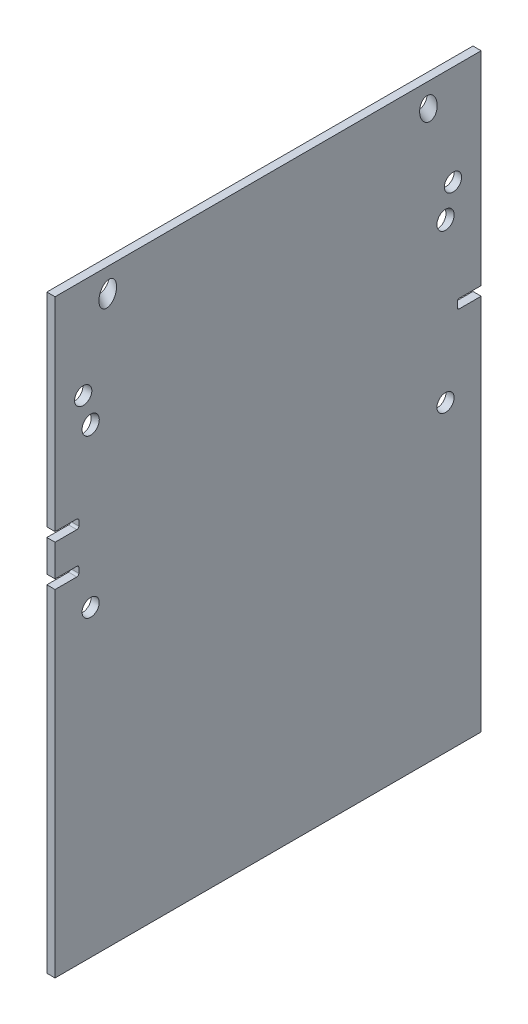
ISO-10303-21;
HEADER;
FILE_DESCRIPTION(('STEP AP214'),'2;1');
FILE_NAME('part.step','',(''),(''),'','','');
FILE_SCHEMA(('AUTOMOTIVE_DESIGN { 1 0 10303 214 1 1 1 1 }'));
ENDSEC;
DATA;
#1=APPLICATION_CONTEXT('core data for automotive mechanical design processes');
#2=APPLICATION_PROTOCOL_DEFINITION('international standard','automotive_design',2000,#1);
#3=PRODUCT_CONTEXT('',#1,'mechanical');
#4=PRODUCT('Part','Part','',(#3));
#5=PRODUCT_RELATED_PRODUCT_CATEGORY('part','',(#4));
#6=PRODUCT_DEFINITION_FORMATION('','',#4);
#7=PRODUCT_DEFINITION_CONTEXT('part definition',#1,'design');
#8=PRODUCT_DEFINITION('design','',#6,#7);
#9=PRODUCT_DEFINITION_SHAPE('','',#8);
#10=(LENGTH_UNIT() NAMED_UNIT(*) SI_UNIT(.MILLI.,.METRE.));
#11=(NAMED_UNIT(*) PLANE_ANGLE_UNIT() SI_UNIT($,.RADIAN.));
#12=(NAMED_UNIT(*) SI_UNIT($,.STERADIAN.) SOLID_ANGLE_UNIT());
#13=UNCERTAINTY_MEASURE_WITH_UNIT(LENGTH_MEASURE(1.E-05),#10,'distance_accuracy_value','');
#14=(GEOMETRIC_REPRESENTATION_CONTEXT(3) GLOBAL_UNCERTAINTY_ASSIGNED_CONTEXT((#13)) GLOBAL_UNIT_ASSIGNED_CONTEXT((#10,
#11,#12)) REPRESENTATION_CONTEXT('',''));
#15=CARTESIAN_POINT('',(0.,0.,0.));
#16=DIRECTION('',(0.,0.,1.));
#17=DIRECTION('',(1.,0.,0.));
#18=AXIS2_PLACEMENT_3D('',#15,#16,#17);
#19=CARTESIAN_POINT('',(2463.8,444.5,330.2));
#20=DIRECTION('',(0.,0.,-1.));
#21=DIRECTION('',(-1.,0.,0.));
#22=AXIS2_PLACEMENT_3D('',#19,#20,#21);
#23=PLANE('',#22);
#24=DIRECTION('',(0.,-1.,0.));
#25=VECTOR('',#24,1.);
#26=CARTESIAN_POINT('',(2463.8,444.5,330.2));
#27=LINE('',#26,#25);
#28=CARTESIAN_POINT('',(2463.8,115.038,330.2));
#29=VERTEX_POINT('',#28);
#30=CARTESIAN_POINT('',(2463.8,65.762,330.2));
#31=VERTEX_POINT('',#30);
#32=EDGE_CURVE('E223',#29,#31,#27,.T.);
#33=ORIENTED_EDGE('',*,*,#32,.T.);
#34=DIRECTION('',(1.,0.,0.));
#35=VECTOR('',#34,1.);
#36=CARTESIAN_POINT('',(2463.8,65.762,330.2));
#37=LINE('',#36,#35);
#38=CARTESIAN_POINT('',(2476.5,65.762,330.2));
#39=VERTEX_POINT('',#38);
#40=EDGE_CURVE('E327',#31,#39,#37,.T.);
#41=ORIENTED_EDGE('',*,*,#40,.T.);
#42=DIRECTION('',(0.,-1.,0.));
#43=VECTOR('',#42,1.);
#44=CARTESIAN_POINT('',(2476.5,444.5,330.2));
#45=LINE('',#44,#43);
#46=CARTESIAN_POINT('',(2476.5,115.038,330.2));
#47=VERTEX_POINT('',#46);
#48=EDGE_CURVE('E261',#47,#39,#45,.T.);
#49=ORIENTED_EDGE('',*,*,#48,.F.);
#50=DIRECTION('',(-1.,0.,0.));
#51=VECTOR('',#50,1.);
#52=CARTESIAN_POINT('',(2463.8,115.038,330.2));
#53=LINE('',#52,#51);
#54=EDGE_CURVE('E312',#47,#29,#53,.T.);
#55=ORIENTED_EDGE('',*,*,#54,.T.);
#56=EDGE_LOOP('',(#33,#41,#49,#55));
#57=FACE_BOUND('',#56,.T.);
#58=ADVANCED_FACE('F44',(#57),#23,.F.);
#59=CARTESIAN_POINT('',(2463.8,444.5,-330.2));
#60=DIRECTION('',(0.,0.,1.));
#61=DIRECTION('',(1.,0.,0.));
#62=AXIS2_PLACEMENT_3D('',#59,#60,#61);
#63=PLANE('',#62);
#64=DIRECTION('',(0.,-1.,0.));
#65=VECTOR('',#64,1.);
#66=CARTESIAN_POINT('',(2463.8,444.5,-330.2));
#67=LINE('',#66,#65);
#68=CARTESIAN_POINT('',(2463.8,115.038,-330.2));
#69=VERTEX_POINT('',#68);
#70=CARTESIAN_POINT('',(2463.8,-469.9,-330.2));
#71=VERTEX_POINT('',#70);
#72=EDGE_CURVE('E247',#69,#71,#67,.T.);
#73=ORIENTED_EDGE('',*,*,#72,.F.);
#74=DIRECTION('',(1.,0.,0.));
#75=VECTOR('',#74,1.);
#76=CARTESIAN_POINT('',(2463.8,115.038,-330.2));
#77=LINE('',#76,#75);
#78=CARTESIAN_POINT('',(2476.5,115.038,-330.2));
#79=VERTEX_POINT('',#78);
#80=EDGE_CURVE('E340',#69,#79,#77,.T.);
#81=ORIENTED_EDGE('',*,*,#80,.T.);
#82=DIRECTION('',(0.,-1.,0.));
#83=VECTOR('',#82,1.);
#84=CARTESIAN_POINT('',(2476.5,444.5,-330.2));
#85=LINE('',#84,#83);
#86=CARTESIAN_POINT('',(2476.5,-469.9,-330.2));
#87=VERTEX_POINT('',#86);
#88=EDGE_CURVE('E256',#79,#87,#85,.T.);
#89=ORIENTED_EDGE('',*,*,#88,.T.);
#90=DIRECTION('',(-1.,0.,0.));
#91=VECTOR('',#90,1.);
#92=CARTESIAN_POINT('',(2463.8,-469.9,-330.2));
#93=LINE('',#92,#91);
#94=EDGE_CURVE('E253',#87,#71,#93,.T.);
#95=ORIENTED_EDGE('',*,*,#94,.T.);
#96=EDGE_LOOP('',(#73,#81,#89,#95));
#97=FACE_BOUND('',#96,.T.);
#98=ADVANCED_FACE('F499',(#97),#63,.F.);
#99=CARTESIAN_POINT('',(2463.8,444.5,330.2));
#100=VERTEX_POINT('',#99);
#101=CARTESIAN_POINT('',(2463.8,129.262,330.2));
#102=VERTEX_POINT('',#101);
#103=EDGE_CURVE('E198',#100,#102,#27,.T.);
#104=ORIENTED_EDGE('',*,*,#103,.T.);
#105=DIRECTION('',(1.,0.,0.));
#106=VECTOR('',#105,1.);
#107=CARTESIAN_POINT('',(2463.8,129.262,330.2));
#108=LINE('',#107,#106);
#109=CARTESIAN_POINT('',(2476.5,129.262,330.2));
#110=VERTEX_POINT('',#109);
#111=EDGE_CURVE('E290',#102,#110,#108,.T.);
#112=ORIENTED_EDGE('',*,*,#111,.T.);
#113=CARTESIAN_POINT('',(2476.5,444.5,330.2));
#114=VERTEX_POINT('',#113);
#115=EDGE_CURVE('E200',#114,#110,#45,.T.);
#116=ORIENTED_EDGE('',*,*,#115,.F.);
#117=DIRECTION('',(1.,0.,0.));
#118=VECTOR('',#117,1.);
#119=CARTESIAN_POINT('',(2463.8,444.5,330.2));
#120=LINE('',#119,#118);
#121=EDGE_CURVE('E193',#100,#114,#120,.T.);
#122=ORIENTED_EDGE('',*,*,#121,.F.);
#123=EDGE_LOOP('',(#104,#112,#116,#122));
#124=FACE_BOUND('',#123,.T.);
#125=ADVANCED_FACE('F195',(#124),#23,.F.);
#126=CARTESIAN_POINT('',(2463.8,444.5,-330.2));
#127=DIRECTION('',(1.,0.,0.));
#128=DIRECTION('',(0.,0.,-1.));
#129=AXIS2_PLACEMENT_3D('',#126,#127,#128);
#130=PLANE('',#129);
#131=DIRECTION('',(0.,0.,-1.));
#132=VECTOR('',#131,1.);
#133=CARTESIAN_POINT('',(2463.8,51.538,-330.2));
#134=LINE('',#133,#132);
#135=CARTESIAN_POINT('',(2463.8,51.538,330.2));
#136=VERTEX_POINT('',#135);
#137=CARTESIAN_POINT('',(2463.8,51.538,296.463));
#138=VERTEX_POINT('',#137);
#139=EDGE_CURVE('E279',#136,#138,#134,.T.);
#140=ORIENTED_EDGE('',*,*,#139,.T.);
#141=CARTESIAN_POINT('',(2463.8,54.713,296.463));
#142=DIRECTION('',(1.,0.,0.));
#143=DIRECTION('',(0.,0.,-1.));
#144=AXIS2_PLACEMENT_3D('',#141,#142,#143);
#145=CIRCLE('',#144,3.175);
#146=CARTESIAN_POINT('',(2463.8,54.713,293.288));
#147=VERTEX_POINT('',#146);
#148=EDGE_CURVE('E468',#138,#147,#145,.T.);
#149=ORIENTED_EDGE('',*,*,#148,.T.);
#150=DIRECTION('',(0.,1.,0.));
#151=VECTOR('',#150,1.);
#152=CARTESIAN_POINT('',(2463.8,52.3,293.288));
#153=LINE('',#152,#151);
#154=CARTESIAN_POINT('',(2463.8,62.587,293.288));
#155=VERTEX_POINT('',#154);
#156=EDGE_CURVE('E280',#147,#155,#153,.T.);
#157=ORIENTED_EDGE('',*,*,#156,.T.);
#158=CARTESIAN_POINT('',(2463.8,62.587,296.463));
#159=DIRECTION('',(1.,0.,0.));
#160=DIRECTION('',(0.,0.,-1.));
#161=AXIS2_PLACEMENT_3D('',#158,#159,#160);
#162=CIRCLE('',#161,3.175);
#163=CARTESIAN_POINT('',(2463.8,65.762,296.463));
#164=VERTEX_POINT('',#163);
#165=EDGE_CURVE('E474',#155,#164,#162,.T.);
#166=ORIENTED_EDGE('',*,*,#165,.T.);
#167=DIRECTION('',(0.,0.,1.));
#168=VECTOR('',#167,1.);
#169=CARTESIAN_POINT('',(2463.8,65.762,-330.2));
#170=LINE('',#169,#168);
#171=EDGE_CURVE('E323',#164,#31,#170,.T.);
#172=ORIENTED_EDGE('',*,*,#171,.T.);
#173=ORIENTED_EDGE('',*,*,#32,.F.);
#174=DIRECTION('',(0.,0.,-1.));
#175=VECTOR('',#174,1.);
#176=CARTESIAN_POINT('',(2463.8,115.038,-330.2));
#177=LINE('',#176,#175);
#178=CARTESIAN_POINT('',(2463.8,115.038,296.463));
#179=VERTEX_POINT('',#178);
#180=EDGE_CURVE('E293',#29,#179,#177,.T.);
#181=ORIENTED_EDGE('',*,*,#180,.T.);
#182=CARTESIAN_POINT('',(2463.8,118.213,296.463));
#183=DIRECTION('',(1.,0.,0.));
#184=DIRECTION('',(0.,0.,-1.));
#185=AXIS2_PLACEMENT_3D('',#182,#183,#184);
#186=CIRCLE('',#185,3.175);
#187=CARTESIAN_POINT('',(2463.8,118.213,293.288));
#188=VERTEX_POINT('',#187);
#189=EDGE_CURVE('E462',#179,#188,#186,.T.);
#190=ORIENTED_EDGE('',*,*,#189,.T.);
#191=DIRECTION('',(0.,1.,0.));
#192=VECTOR('',#191,1.);
#193=CARTESIAN_POINT('',(2463.8,115.8,293.288));
#194=LINE('',#193,#192);
#195=CARTESIAN_POINT('',(2463.8,126.087,293.288));
#196=VERTEX_POINT('',#195);
#197=EDGE_CURVE('E296',#188,#196,#194,.T.);
#198=ORIENTED_EDGE('',*,*,#197,.T.);
#199=CARTESIAN_POINT('',(2463.8,126.087,296.463));
#200=DIRECTION('',(1.,0.,0.));
#201=DIRECTION('',(0.,0.,-1.));
#202=AXIS2_PLACEMENT_3D('',#199,#200,#201);
#203=CIRCLE('',#202,3.175);
#204=CARTESIAN_POINT('',(2463.8,129.262,296.463));
#205=VERTEX_POINT('',#204);
#206=EDGE_CURVE('E12',#196,#205,#203,.T.);
#207=ORIENTED_EDGE('',*,*,#206,.T.);
#208=DIRECTION('',(0.,0.,1.));
#209=VECTOR('',#208,1.);
#210=CARTESIAN_POINT('',(2463.8,129.262,-330.2));
#211=LINE('',#210,#209);
#212=EDGE_CURVE('E219',#205,#102,#211,.T.);
#213=ORIENTED_EDGE('',*,*,#212,.T.);
#214=ORIENTED_EDGE('',*,*,#103,.F.);
#215=DIRECTION('',(0.,0.,1.));
#216=VECTOR('',#215,1.);
#217=CARTESIAN_POINT('',(2463.8,444.5,-330.2));
#218=LINE('',#217,#216);
#219=CARTESIAN_POINT('',(2463.8,444.5,-330.2));
#220=VERTEX_POINT('',#219);
#221=EDGE_CURVE('E205',#220,#100,#218,.T.);
#222=ORIENTED_EDGE('',*,*,#221,.F.);
#223=CARTESIAN_POINT('',(2463.8,129.262,-330.2));
#224=VERTEX_POINT('',#223);
#225=EDGE_CURVE('E242',#220,#224,#67,.T.);
#226=ORIENTED_EDGE('',*,*,#225,.T.);
#227=DIRECTION('',(0.,0.,1.));
#228=VECTOR('',#227,1.);
#229=CARTESIAN_POINT('',(2463.8,129.262,-330.2));
#230=LINE('',#229,#228);
#231=CARTESIAN_POINT('',(2463.8,129.262,-296.463000000001));
#232=VERTEX_POINT('',#231);
#233=EDGE_CURVE('E867',#224,#232,#230,.T.);
#234=ORIENTED_EDGE('',*,*,#233,.T.);
#235=CARTESIAN_POINT('',(2463.8,126.087,-296.463000000001));
#236=DIRECTION('',(1.,0.,0.));
#237=DIRECTION('',(0.,0.,-1.));
#238=AXIS2_PLACEMENT_3D('',#235,#236,#237);
#239=CIRCLE('',#238,3.175);
#240=CARTESIAN_POINT('',(2463.8,126.087,-293.288000000001));
#241=VERTEX_POINT('',#240);
#242=EDGE_CURVE('E456',#232,#241,#239,.T.);
#243=ORIENTED_EDGE('',*,*,#242,.T.);
#244=DIRECTION('',(0.,-1.,0.));
#245=VECTOR('',#244,1.);
#246=CARTESIAN_POINT('',(2463.8,128.5,-293.288000000001));
#247=LINE('',#246,#245);
#248=CARTESIAN_POINT('',(2463.8,118.213,-293.288000000001));
#249=VERTEX_POINT('',#248);
#250=EDGE_CURVE('E868',#241,#249,#247,.T.);
#251=ORIENTED_EDGE('',*,*,#250,.T.);
#252=CARTESIAN_POINT('',(2463.8,118.213,-296.463000000001));
#253=DIRECTION('',(1.,0.,0.));
#254=DIRECTION('',(0.,0.,-1.));
#255=AXIS2_PLACEMENT_3D('',#252,#253,#254);
#256=CIRCLE('',#255,3.175);
#257=CARTESIAN_POINT('',(2463.8,115.038,-296.463000000001));
#258=VERTEX_POINT('',#257);
#259=EDGE_CURVE('E450',#249,#258,#256,.T.);
#260=ORIENTED_EDGE('',*,*,#259,.T.);
#261=DIRECTION('',(0.,0.,-1.));
#262=VECTOR('',#261,1.);
#263=CARTESIAN_POINT('',(2463.8,115.038,-330.2));
#264=LINE('',#263,#262);
#265=EDGE_CURVE('E308',#258,#69,#264,.T.);
#266=ORIENTED_EDGE('',*,*,#265,.T.);
#267=ORIENTED_EDGE('',*,*,#72,.T.);
#268=DIRECTION('',(0.,0.,1.));
#269=VECTOR('',#268,1.);
#270=CARTESIAN_POINT('',(2463.8,-469.9,-330.2));
#271=LINE('',#270,#269);
#272=CARTESIAN_POINT('',(2463.8,-469.9,330.2));
#273=VERTEX_POINT('',#272);
#274=EDGE_CURVE('E250',#71,#273,#271,.T.);
#275=ORIENTED_EDGE('',*,*,#274,.T.);
#276=EDGE_CURVE('E225',#136,#273,#27,.T.);
#277=ORIENTED_EDGE('',*,*,#276,.F.);
#278=EDGE_LOOP('',(#140,#149,#157,#166,#172,#173,#181,#190,#198,#207,#213,#214,#222,#226,#234,
#243,#251,#260,#266,#267,#275,#277));
#279=FACE_BOUND('',#278,.T.);
#280=CARTESIAN_POINT('',(2463.8,240.627500000009,-275.000000000001));
#281=DIRECTION('',(1.,0.,0.));
#282=DIRECTION('',(0.,1.,0.));
#283=AXIS2_PLACEMENT_3D('',#280,#281,#282);
#284=ELLIPSE('',#283,14.1841170593698,13.335);
#285=CARTESIAN_POINT('',(2463.8,254.811617059379,-275.000000000001));
#286=VERTEX_POINT('',#285);
#287=EDGE_CURVE('E311',#286,#286,#284,.F.);
#288=ORIENTED_EDGE('',*,*,#287,.F.);
#289=EDGE_LOOP('',(#288));
#290=FACE_BOUND('',#289,.T.);
#291=CARTESIAN_POINT('',(2463.8,-7.12133119048504E-13,-275.000000000001));
#292=DIRECTION('',(1.,0.,0.));
#293=DIRECTION('',(0.,0.,-1.));
#294=AXIS2_PLACEMENT_3D('',#291,#292,#293);
#295=CIRCLE('',#294,13.335);
#296=CARTESIAN_POINT('',(2463.8,-7.12133119048504E-13,-288.335000000001));
#297=VERTEX_POINT('',#296);
#298=EDGE_CURVE('E389',#297,#297,#295,.F.);
#299=ORIENTED_EDGE('',*,*,#298,.F.);
#300=EDGE_LOOP('',(#299));
#301=FACE_BOUND('',#300,.T.);
#302=CARTESIAN_POINT('',(2463.8,289.999999999994,-287.768749999998));
#303=DIRECTION('',(1.,0.,0.));
#304=DIRECTION('',(0.,-1.68753899743025E-13,-1.));
#305=AXIS2_PLACEMENT_3D('',#302,#303,#304);
#306=ELLIPSE('',#305,13.3934728748526,13.335);
#307=CARTESIAN_POINT('',(2463.8,289.999999999991,-301.16222287485));
#308=VERTEX_POINT('',#307);
#309=EDGE_CURVE('E390',#308,#308,#306,.F.);
#310=ORIENTED_EDGE('',*,*,#309,.F.);
#311=EDGE_LOOP('',(#310));
#312=FACE_BOUND('',#311,.T.);
#313=CARTESIAN_POINT('',(2463.8,419.804647774969,-245.782156472755));
#314=DIRECTION('',(1.,0.,0.));
#315=DIRECTION('',(0.,0.975590762994734,0.219596591866432));
#316=AXIS2_PLACEMENT_3D('',#313,#314,#315);
#317=ELLIPSE('',#316,18.6418967373264,13.3350000000001);
#318=CARTESIAN_POINT('',(2463.8,437.991510036606,-241.688459483312));
#319=VERTEX_POINT('',#318);
#320=EDGE_CURVE('E348',#319,#319,#317,.F.);
#321=ORIENTED_EDGE('',*,*,#320,.F.);
#322=EDGE_LOOP('',(#321));
#323=FACE_BOUND('',#322,.T.);
#324=CARTESIAN_POINT('',(2463.8,419.804647774969,245.782156472754));
#325=DIRECTION('',(1.,0.,0.));
#326=DIRECTION('',(0.,-0.975590762994734,0.219596591866431));
#327=AXIS2_PLACEMENT_3D('',#324,#325,#326);
#328=ELLIPSE('',#327,18.6418967373263,13.335);
#329=CARTESIAN_POINT('',(2463.8,401.617785513332,249.875853462197));
#330=VERTEX_POINT('',#329);
#331=EDGE_CURVE('E349',#330,#330,#328,.F.);
#332=ORIENTED_EDGE('',*,*,#331,.F.);
#333=EDGE_LOOP('',(#332));
#334=FACE_BOUND('',#333,.T.);
#335=CARTESIAN_POINT('',(2463.8,240.627500000009,275.));
#336=DIRECTION('',(1.,0.,0.));
#337=DIRECTION('',(0.,-1.,0.));
#338=AXIS2_PLACEMENT_3D('',#335,#336,#337);
#339=ELLIPSE('',#338,14.1841170593698,13.335);
#340=CARTESIAN_POINT('',(2463.8,226.443382940639,275.));
#341=VERTEX_POINT('',#340);
#342=EDGE_CURVE('E358',#341,#341,#339,.F.);
#343=ORIENTED_EDGE('',*,*,#342,.F.);
#344=EDGE_LOOP('',(#343));
#345=FACE_BOUND('',#344,.T.);
#346=CARTESIAN_POINT('',(2463.8,-4.18286707223905E-12,275.));
#347=DIRECTION('',(1.,0.,0.));
#348=DIRECTION('',(0.,0.,-1.));
#349=AXIS2_PLACEMENT_3D('',#346,#347,#348);
#350=CIRCLE('',#349,13.335);
#351=CARTESIAN_POINT('',(2463.8,-4.18286707223905E-12,261.665));
#352=VERTEX_POINT('',#351);
#353=EDGE_CURVE('E375',#352,#352,#350,.F.);
#354=ORIENTED_EDGE('',*,*,#353,.F.);
#355=EDGE_LOOP('',(#354));
#356=FACE_BOUND('',#355,.T.);
#357=CARTESIAN_POINT('',(2463.8,289.999999999994,287.768749999997));
#358=DIRECTION('',(1.,0.,0.));
#359=DIRECTION('',(0.,-1.70234197109192E-13,1.));
#360=AXIS2_PLACEMENT_3D('',#357,#358,#359);
#361=ELLIPSE('',#360,13.3934728748526,13.335);
#362=CARTESIAN_POINT('',(2463.8,289.999999999991,301.162222874849));
#363=VERTEX_POINT('',#362);
#364=EDGE_CURVE('E366',#363,#363,#361,.F.);
#365=ORIENTED_EDGE('',*,*,#364,.F.);
#366=EDGE_LOOP('',(#365));
#367=FACE_BOUND('',#366,.T.);
#368=ADVANCED_FACE('F217',(#279,#290,#301,#312,#323,#334,#345,#356,#367),#130,.F.);
#369=CARTESIAN_POINT('',(2476.5,51.538,330.2));
#370=VERTEX_POINT('',#369);
#371=CARTESIAN_POINT('',(2476.5,-469.9,330.2));
#372=VERTEX_POINT('',#371);
#373=EDGE_CURVE('E229',#370,#372,#45,.T.);
#374=ORIENTED_EDGE('',*,*,#373,.F.);
#375=DIRECTION('',(-1.,0.,0.));
#376=VECTOR('',#375,1.);
#377=CARTESIAN_POINT('',(2463.8,51.538,330.2));
#378=LINE('',#377,#376);
#379=EDGE_CURVE('E276',#370,#136,#378,.T.);
#380=ORIENTED_EDGE('',*,*,#379,.T.);
#381=ORIENTED_EDGE('',*,*,#276,.T.);
#382=DIRECTION('',(1.,0.,0.));
#383=VECTOR('',#382,1.);
#384=CARTESIAN_POINT('',(2463.8,-469.9,330.2));
#385=LINE('',#384,#383);
#386=EDGE_CURVE('E235',#273,#372,#385,.T.);
#387=ORIENTED_EDGE('',*,*,#386,.T.);
#388=EDGE_LOOP('',(#374,#380,#381,#387));
#389=FACE_BOUND('',#388,.T.);
#390=ADVANCED_FACE('F275',(#389),#23,.F.);
#391=CARTESIAN_POINT('',(2476.5,444.5,-330.2));
#392=DIRECTION('',(-1.,0.,0.));
#393=DIRECTION('',(0.,0.,1.));
#394=AXIS2_PLACEMENT_3D('',#391,#392,#393);
#395=PLANE('',#394);
#396=DIRECTION('',(0.,1.,0.));
#397=VECTOR('',#396,1.);
#398=CARTESIAN_POINT('',(2476.5,444.5,293.288));
#399=LINE('',#398,#397);
#400=CARTESIAN_POINT('',(2476.5,54.713,293.288));
#401=VERTEX_POINT('',#400);
#402=CARTESIAN_POINT('',(2476.5,62.5869999999999,293.288));
#403=VERTEX_POINT('',#402);
#404=EDGE_CURVE('E322',#401,#403,#399,.T.);
#405=ORIENTED_EDGE('',*,*,#404,.F.);
#406=CARTESIAN_POINT('',(2476.5,54.713,296.463));
#407=DIRECTION('',(-1.,0.,0.));
#408=DIRECTION('',(0.,0.,1.));
#409=AXIS2_PLACEMENT_3D('',#406,#407,#408);
#410=CIRCLE('',#409,3.175);
#411=CARTESIAN_POINT('',(2476.5,51.538,296.463));
#412=VERTEX_POINT('',#411);
#413=EDGE_CURVE('E465',#401,#412,#410,.T.);
#414=ORIENTED_EDGE('',*,*,#413,.T.);
#415=DIRECTION('',(0.,0.,1.));
#416=VECTOR('',#415,1.);
#417=CARTESIAN_POINT('',(2476.5,51.538,-330.2));
#418=LINE('',#417,#416);
#419=EDGE_CURVE('E273',#412,#370,#418,.T.);
#420=ORIENTED_EDGE('',*,*,#419,.T.);
#421=ORIENTED_EDGE('',*,*,#373,.T.);
#422=DIRECTION('',(0.,0.,-1.));
#423=VECTOR('',#422,1.);
#424=CARTESIAN_POINT('',(2476.5,-469.9,-330.2));
#425=LINE('',#424,#423);
#426=EDGE_CURVE('E222',#372,#87,#425,.T.);
#427=ORIENTED_EDGE('',*,*,#426,.T.);
#428=ORIENTED_EDGE('',*,*,#88,.F.);
#429=DIRECTION('',(0.,0.,1.));
#430=VECTOR('',#429,1.);
#431=CARTESIAN_POINT('',(2476.5,115.038,-330.2));
#432=LINE('',#431,#430);
#433=CARTESIAN_POINT('',(2476.5,115.038,-296.463000000001));
#434=VERTEX_POINT('',#433);
#435=EDGE_CURVE('E878',#79,#434,#432,.T.);
#436=ORIENTED_EDGE('',*,*,#435,.T.);
#437=CARTESIAN_POINT('',(2476.5,118.213,-296.463000000001));
#438=DIRECTION('',(-1.,0.,0.));
#439=DIRECTION('',(0.,0.,1.));
#440=AXIS2_PLACEMENT_3D('',#437,#438,#439);
#441=CIRCLE('',#440,3.175);
#442=CARTESIAN_POINT('',(2476.5,118.213,-293.288000000001));
#443=VERTEX_POINT('',#442);
#444=EDGE_CURVE('E447',#434,#443,#441,.T.);
#445=ORIENTED_EDGE('',*,*,#444,.T.);
#446=DIRECTION('',(0.,-1.,0.));
#447=VECTOR('',#446,1.);
#448=CARTESIAN_POINT('',(2476.5,444.5,-293.288000000001));
#449=LINE('',#448,#447);
#450=CARTESIAN_POINT('',(2476.5,126.087,-293.288000000001));
#451=VERTEX_POINT('',#450);
#452=EDGE_CURVE('E326',#451,#443,#449,.T.);
#453=ORIENTED_EDGE('',*,*,#452,.F.);
#454=CARTESIAN_POINT('',(2476.5,126.087,-296.463000000001));
#455=DIRECTION('',(-1.,0.,0.));
#456=DIRECTION('',(0.,0.,1.));
#457=AXIS2_PLACEMENT_3D('',#454,#455,#456);
#458=CIRCLE('',#457,3.175);
#459=CARTESIAN_POINT('',(2476.5,129.262,-296.463000000001));
#460=VERTEX_POINT('',#459);
#461=EDGE_CURVE('E453',#451,#460,#458,.T.);
#462=ORIENTED_EDGE('',*,*,#461,.T.);
#463=DIRECTION('',(0.,0.,-1.));
#464=VECTOR('',#463,1.);
#465=CARTESIAN_POINT('',(2476.5,129.262,-330.2));
#466=LINE('',#465,#464);
#467=CARTESIAN_POINT('',(2476.5,129.262,-330.2));
#468=VERTEX_POINT('',#467);
#469=EDGE_CURVE('E863',#460,#468,#466,.T.);
#470=ORIENTED_EDGE('',*,*,#469,.T.);
#471=CARTESIAN_POINT('',(2476.5,444.5,-330.2));
#472=VERTEX_POINT('',#471);
#473=EDGE_CURVE('E214',#472,#468,#85,.T.);
#474=ORIENTED_EDGE('',*,*,#473,.F.);
#475=DIRECTION('',(0.,0.,-1.));
#476=VECTOR('',#475,1.);
#477=CARTESIAN_POINT('',(2476.5,444.5,-330.2));
#478=LINE('',#477,#476);
#479=EDGE_CURVE('E204',#114,#472,#478,.T.);
#480=ORIENTED_EDGE('',*,*,#479,.F.);
#481=ORIENTED_EDGE('',*,*,#115,.T.);
#482=DIRECTION('',(0.,0.,-1.));
#483=VECTOR('',#482,1.);
#484=CARTESIAN_POINT('',(2476.5,129.262,-330.2));
#485=LINE('',#484,#483);
#486=CARTESIAN_POINT('',(2476.5,129.262,296.463));
#487=VERTEX_POINT('',#486);
#488=EDGE_CURVE('E299',#110,#487,#485,.T.);
#489=ORIENTED_EDGE('',*,*,#488,.T.);
#490=CARTESIAN_POINT('',(2476.5,126.087,296.463));
#491=DIRECTION('',(-1.,0.,0.));
#492=DIRECTION('',(0.,0.,1.));
#493=AXIS2_PLACEMENT_3D('',#490,#491,#492);
#494=CIRCLE('',#493,3.175);
#495=CARTESIAN_POINT('',(2476.5,126.087,293.288));
#496=VERTEX_POINT('',#495);
#497=EDGE_CURVE('E53',#487,#496,#494,.T.);
#498=ORIENTED_EDGE('',*,*,#497,.T.);
#499=DIRECTION('',(0.,1.,0.));
#500=VECTOR('',#499,1.);
#501=CARTESIAN_POINT('',(2476.5,444.5,293.288));
#502=LINE('',#501,#500);
#503=CARTESIAN_POINT('',(2476.5,118.213,293.288));
#504=VERTEX_POINT('',#503);
#505=EDGE_CURVE('E304',#504,#496,#502,.T.);
#506=ORIENTED_EDGE('',*,*,#505,.F.);
#507=CARTESIAN_POINT('',(2476.5,118.213,296.463));
#508=DIRECTION('',(-1.,0.,0.));
#509=DIRECTION('',(0.,0.,1.));
#510=AXIS2_PLACEMENT_3D('',#507,#508,#509);
#511=CIRCLE('',#510,3.175);
#512=CARTESIAN_POINT('',(2476.5,115.038,296.463));
#513=VERTEX_POINT('',#512);
#514=EDGE_CURVE('E459',#504,#513,#511,.T.);
#515=ORIENTED_EDGE('',*,*,#514,.T.);
#516=DIRECTION('',(0.,0.,1.));
#517=VECTOR('',#516,1.);
#518=CARTESIAN_POINT('',(2476.5,115.038,-330.2));
#519=LINE('',#518,#517);
#520=EDGE_CURVE('E303',#513,#47,#519,.T.);
#521=ORIENTED_EDGE('',*,*,#520,.T.);
#522=ORIENTED_EDGE('',*,*,#48,.T.);
#523=DIRECTION('',(0.,0.,-1.));
#524=VECTOR('',#523,1.);
#525=CARTESIAN_POINT('',(2476.5,65.762,-330.2));
#526=LINE('',#525,#524);
#527=CARTESIAN_POINT('',(2476.5,65.762,296.463));
#528=VERTEX_POINT('',#527);
#529=EDGE_CURVE('E331',#39,#528,#526,.T.);
#530=ORIENTED_EDGE('',*,*,#529,.T.);
#531=CARTESIAN_POINT('',(2476.5,62.587,296.463));
#532=DIRECTION('',(-1.,0.,0.));
#533=DIRECTION('',(0.,0.,1.));
#534=AXIS2_PLACEMENT_3D('',#531,#532,#533);
#535=CIRCLE('',#534,3.175);
#536=EDGE_CURVE('E471',#528,#403,#535,.T.);
#537=ORIENTED_EDGE('',*,*,#536,.T.);
#538=EDGE_LOOP('',(#405,#414,#420,#421,#427,#428,#436,#445,#453,#462,#470,#474,#480,#481,#489,
#498,#506,#515,#521,#522,#530,#537));
#539=FACE_BOUND('',#538,.T.);
#540=CARTESIAN_POINT('',(2476.5,245.231250000009,-275.000000000001));
#541=DIRECTION('',(-1.,0.,0.));
#542=DIRECTION('',(0.,1.,0.));
#543=AXIS2_PLACEMENT_3D('',#540,#541,#542);
#544=ELLIPSE('',#543,14.1841170593698,13.335);
#545=CARTESIAN_POINT('',(2476.5,259.415367059379,-275.000000000001));
#546=VERTEX_POINT('',#545);
#547=EDGE_CURVE('E394',#546,#546,#544,.F.);
#548=ORIENTED_EDGE('',*,*,#547,.F.);
#549=EDGE_LOOP('',(#548));
#550=FACE_BOUND('',#549,.T.);
#551=CARTESIAN_POINT('',(2476.5,-6.45730104276708E-13,-275.000000000001));
#552=DIRECTION('',(-1.,0.,0.));
#553=DIRECTION('',(0.,0.,1.));
#554=AXIS2_PLACEMENT_3D('',#551,#552,#553);
#555=CIRCLE('',#554,13.335);
#556=CARTESIAN_POINT('',(2476.5,-6.45730104276708E-13,-261.665000000001));
#557=VERTEX_POINT('',#556);
#558=EDGE_CURVE('E385',#557,#557,#555,.F.);
#559=ORIENTED_EDGE('',*,*,#558,.F.);
#560=EDGE_LOOP('',(#559));
#561=FACE_BOUND('',#560,.T.);
#562=CARTESIAN_POINT('',(2476.5,289.999999999994,-286.578124999997));
#563=DIRECTION('',(-1.,0.,0.));
#564=DIRECTION('',(0.,-1.68753899743025E-13,-1.));
#565=AXIS2_PLACEMENT_3D('',#562,#563,#564);
#566=ELLIPSE('',#565,13.3934728748526,13.335);
#567=CARTESIAN_POINT('',(2476.5,289.999999999991,-299.97159787485));
#568=VERTEX_POINT('',#567);
#569=EDGE_CURVE('E353',#568,#568,#566,.F.);
#570=ORIENTED_EDGE('',*,*,#569,.F.);
#571=EDGE_LOOP('',(#570));
#572=FACE_BOUND('',#571,.T.);
#573=CARTESIAN_POINT('',(2476.5,407.700983848811,-248.506580942624));
#574=DIRECTION('',(-1.,0.,0.));
#575=DIRECTION('',(0.,0.975590762994734,0.219596591866432));
#576=AXIS2_PLACEMENT_3D('',#573,#574,#575);
#577=ELLIPSE('',#576,18.6418967373264,13.3350000000001);
#578=CARTESIAN_POINT('',(2476.5,425.887846110449,-244.412883953181));
#579=VERTEX_POINT('',#578);
#580=EDGE_CURVE('E344',#579,#579,#577,.F.);
#581=ORIENTED_EDGE('',*,*,#580,.F.);
#582=EDGE_LOOP('',(#581));
#583=FACE_BOUND('',#582,.T.);
#584=CARTESIAN_POINT('',(2476.5,407.700983848812,248.506580942623));
#585=DIRECTION('',(-1.,0.,0.));
#586=DIRECTION('',(0.,-0.975590762994734,0.219596591866431));
#587=AXIS2_PLACEMENT_3D('',#584,#585,#586);
#588=ELLIPSE('',#587,18.6418967373263,13.335);
#589=CARTESIAN_POINT('',(2476.5,389.514121587175,252.600277932066));
#590=VERTEX_POINT('',#589);
#591=EDGE_CURVE('E354',#590,#590,#588,.F.);
#592=ORIENTED_EDGE('',*,*,#591,.F.);
#593=EDGE_LOOP('',(#592));
#594=FACE_BOUND('',#593,.T.);
#595=CARTESIAN_POINT('',(2476.5,245.231250000009,275.));
#596=DIRECTION('',(-1.,0.,0.));
#597=DIRECTION('',(0.,-1.,0.));
#598=AXIS2_PLACEMENT_3D('',#595,#596,#597);
#599=ELLIPSE('',#598,14.1841170593698,13.335);
#600=CARTESIAN_POINT('',(2476.5,231.047132940639,275.));
#601=VERTEX_POINT('',#600);
#602=EDGE_CURVE('E371',#601,#601,#599,.F.);
#603=ORIENTED_EDGE('',*,*,#602,.F.);
#604=EDGE_LOOP('',(#603));
#605=FACE_BOUND('',#604,.T.);
#606=CARTESIAN_POINT('',(2476.5,-4.18286707223905E-12,275.));
#607=DIRECTION('',(-1.,0.,0.));
#608=DIRECTION('',(0.,0.,1.));
#609=AXIS2_PLACEMENT_3D('',#606,#607,#608);
#610=CIRCLE('',#609,13.335);
#611=CARTESIAN_POINT('',(2476.5,-4.18286707223905E-12,288.335));
#612=VERTEX_POINT('',#611);
#613=EDGE_CURVE('E370',#612,#612,#610,.F.);
#614=ORIENTED_EDGE('',*,*,#613,.F.);
#615=EDGE_LOOP('',(#614));
#616=FACE_BOUND('',#615,.T.);
#617=CARTESIAN_POINT('',(2476.5,289.999999999994,286.578124999997));
#618=DIRECTION('',(-1.,0.,0.));
#619=DIRECTION('',(0.,-1.70234197109192E-13,1.));
#620=AXIS2_PLACEMENT_3D('',#617,#618,#619);
#621=ELLIPSE('',#620,13.3934728748526,13.335);
#622=CARTESIAN_POINT('',(2476.5,289.999999999992,299.971597874849));
#623=VERTEX_POINT('',#622);
#624=EDGE_CURVE('E362',#623,#623,#621,.F.);
#625=ORIENTED_EDGE('',*,*,#624,.F.);
#626=EDGE_LOOP('',(#625));
#627=FACE_BOUND('',#626,.T.);
#628=ADVANCED_FACE('F268',(#539,#550,#561,#572,#583,#594,#605,#616,#627),#395,.F.);
#629=ORIENTED_EDGE('',*,*,#473,.T.);
#630=DIRECTION('',(-1.,0.,0.));
#631=VECTOR('',#630,1.);
#632=CARTESIAN_POINT('',(2463.8,129.262,-330.2));
#633=LINE('',#632,#631);
#634=EDGE_CURVE('E302',#468,#224,#633,.T.);
#635=ORIENTED_EDGE('',*,*,#634,.T.);
#636=ORIENTED_EDGE('',*,*,#225,.F.);
#637=DIRECTION('',(-1.,0.,0.));
#638=VECTOR('',#637,1.);
#639=CARTESIAN_POINT('',(2463.8,444.5,-330.2));
#640=LINE('',#639,#638);
#641=EDGE_CURVE('E210',#472,#220,#640,.T.);
#642=ORIENTED_EDGE('',*,*,#641,.F.);
#643=EDGE_LOOP('',(#629,#635,#636,#642));
#644=FACE_BOUND('',#643,.T.);
#645=ADVANCED_FACE('F507',(#644),#63,.F.);
#646=CARTESIAN_POINT('',(0.,444.5,0.));
#647=DIRECTION('',(0.,1.,0.));
#648=DIRECTION('',(0.,0.,1.));
#649=AXIS2_PLACEMENT_3D('',#646,#647,#648);
#650=PLANE('',#649);
#651=ORIENTED_EDGE('',*,*,#221,.T.);
#652=ORIENTED_EDGE('',*,*,#121,.T.);
#653=ORIENTED_EDGE('',*,*,#479,.T.);
#654=ORIENTED_EDGE('',*,*,#641,.T.);
#655=EDGE_LOOP('',(#651,#652,#653,#654));
#656=FACE_BOUND('',#655,.T.);
#657=ADVANCED_FACE('F208',(#656),#650,.T.);
#658=CARTESIAN_POINT('',(0.,-469.9,0.));
#659=DIRECTION('',(0.,1.,0.));
#660=DIRECTION('',(0.,0.,1.));
#661=AXIS2_PLACEMENT_3D('',#658,#659,#660);
#662=PLANE('',#661);
#663=ORIENTED_EDGE('',*,*,#274,.F.);
#664=ORIENTED_EDGE('',*,*,#94,.F.);
#665=ORIENTED_EDGE('',*,*,#426,.F.);
#666=ORIENTED_EDGE('',*,*,#386,.F.);
#667=EDGE_LOOP('',(#663,#664,#665,#666));
#668=FACE_BOUND('',#667,.T.);
#669=ADVANCED_FACE('F569',(#668),#662,.F.);
#670=CARTESIAN_POINT('',(2599.99999999996,289.999999999996,275.));
#671=DIRECTION('',(-0.995634226059288,0.,0.0933407086930576));
#672=DIRECTION('',(0.0933407086930577,0.,0.995634226059288));
#673=AXIS2_PLACEMENT_3D('',#670,#671,#672);
#674=CYLINDRICAL_SURFACE('',#673,13.335);
#675=ORIENTED_EDGE('',*,*,#624,.T.);
#676=EDGE_LOOP('',(#675));
#677=FACE_BOUND('',#676,.T.);
#678=ORIENTED_EDGE('',*,*,#364,.T.);
#679=EDGE_LOOP('',(#678));
#680=FACE_BOUND('',#679,.T.);
#681=ADVANCED_FACE('F562',(#677,#680),#674,.F.);
#682=CARTESIAN_POINT('',(2599.99999999996,-4.18286707223905E-12,275.));
#683=DIRECTION('',(-1.,0.,0.));
#684=DIRECTION('',(0.,0.,1.));
#685=AXIS2_PLACEMENT_3D('',#682,#683,#684);
#686=CYLINDRICAL_SURFACE('',#685,13.335);
#687=ORIENTED_EDGE('',*,*,#613,.T.);
#688=EDGE_LOOP('',(#687));
#689=FACE_BOUND('',#688,.T.);
#690=ORIENTED_EDGE('',*,*,#353,.T.);
#691=EDGE_LOOP('',(#690));
#692=FACE_BOUND('',#691,.T.);
#693=ADVANCED_FACE('F558',(#689,#692),#686,.F.);
#694=CARTESIAN_POINT('',(2599.99999999996,289.999999999996,275.));
#695=DIRECTION('',(-0.940136065162483,-0.3407993236214,0.));
#696=DIRECTION('',(0.3407993236214,-0.940136065162483,0.));
#697=AXIS2_PLACEMENT_3D('',#694,#695,#696);
#698=CYLINDRICAL_SURFACE('',#697,13.335);
#699=ORIENTED_EDGE('',*,*,#602,.T.);
#700=EDGE_LOOP('',(#699));
#701=FACE_BOUND('',#700,.T.);
#702=ORIENTED_EDGE('',*,*,#342,.T.);
#703=EDGE_LOOP('',(#702));
#704=FACE_BOUND('',#703,.T.);
#705=ADVANCED_FACE('F561',(#701,#704),#698,.F.);
#706=CARTESIAN_POINT('',(1799.99999999996,1052.43552290753,103.38271055945));
#707=DIRECTION('',(0.715324206967608,-0.681735732234708,0.153452501838741));
#708=DIRECTION('',(0.689906973200086,0.723898037246887,0.));
#709=AXIS2_PLACEMENT_3D('',#706,#707,#708);
#710=CYLINDRICAL_SURFACE('',#709,13.335);
#711=ORIENTED_EDGE('',*,*,#591,.T.);
#712=EDGE_LOOP('',(#711));
#713=FACE_BOUND('',#712,.T.);
#714=ORIENTED_EDGE('',*,*,#331,.T.);
#715=EDGE_LOOP('',(#714));
#716=FACE_BOUND('',#715,.T.);
#717=ADVANCED_FACE('F550',(#713,#716),#710,.F.);
#718=CARTESIAN_POINT('',(2599.99999999996,289.999999999996,-275.000000000001));
#719=DIRECTION('',(-0.715324206967608,0.681735732234708,0.153452501838741));
#720=DIRECTION('',(-0.689906973200086,-0.723898037246887,0.));
#721=AXIS2_PLACEMENT_3D('',#718,#719,#720);
#722=CYLINDRICAL_SURFACE('',#721,13.3350000000001);
#723=ORIENTED_EDGE('',*,*,#580,.T.);
#724=EDGE_LOOP('',(#723));
#725=FACE_BOUND('',#724,.T.);
#726=ORIENTED_EDGE('',*,*,#320,.T.);
#727=EDGE_LOOP('',(#726));
#728=FACE_BOUND('',#727,.T.);
#729=ADVANCED_FACE('F546',(#725,#728),#722,.F.);
#730=CARTESIAN_POINT('',(2599.99999999996,289.999999999996,-275.000000000001));
#731=DIRECTION('',(-0.995634226059288,0.,-0.0933407086930576));
#732=DIRECTION('',(-0.0933407086930577,0.,0.995634226059288));
#733=AXIS2_PLACEMENT_3D('',#730,#731,#732);
#734=CYLINDRICAL_SURFACE('',#733,13.335);
#735=ORIENTED_EDGE('',*,*,#569,.T.);
#736=EDGE_LOOP('',(#735));
#737=FACE_BOUND('',#736,.T.);
#738=ORIENTED_EDGE('',*,*,#309,.T.);
#739=EDGE_LOOP('',(#738));
#740=FACE_BOUND('',#739,.T.);
#741=ADVANCED_FACE('F549',(#737,#740),#734,.F.);
#742=CARTESIAN_POINT('',(1799.99999999996,-4.18286707223905E-12,-275.000000000001));
#743=DIRECTION('',(1.,0.,0.));
#744=DIRECTION('',(0.,1.,0.));
#745=AXIS2_PLACEMENT_3D('',#742,#743,#744);
#746=CYLINDRICAL_SURFACE('',#745,13.335);
#747=ORIENTED_EDGE('',*,*,#558,.T.);
#748=EDGE_LOOP('',(#747));
#749=FACE_BOUND('',#748,.T.);
#750=ORIENTED_EDGE('',*,*,#298,.T.);
#751=EDGE_LOOP('',(#750));
#752=FACE_BOUND('',#751,.T.);
#753=ADVANCED_FACE('F494',(#749,#752),#746,.F.);
#754=CARTESIAN_POINT('',(1799.99999999996,-4.27435864480685E-12,-275.000000000001));
#755=DIRECTION('',(0.940136065162483,0.3407993236214,0.));
#756=DIRECTION('',(-0.3407993236214,0.940136065162483,0.));
#757=AXIS2_PLACEMENT_3D('',#754,#755,#756);
#758=CYLINDRICAL_SURFACE('',#757,13.335);
#759=ORIENTED_EDGE('',*,*,#547,.T.);
#760=EDGE_LOOP('',(#759));
#761=FACE_BOUND('',#760,.T.);
#762=ORIENTED_EDGE('',*,*,#287,.T.);
#763=EDGE_LOOP('',(#762));
#764=FACE_BOUND('',#763,.T.);
#765=ADVANCED_FACE('F486',(#761,#764),#758,.F.);
#766=CARTESIAN_POINT('',(2260.6,129.262,249.6));
#767=DIRECTION('',(0.,1.,0.));
#768=DIRECTION('',(0.,0.,1.));
#769=AXIS2_PLACEMENT_3D('',#766,#767,#768);
#770=PLANE('',#769);
#771=ORIENTED_EDGE('',*,*,#212,.F.);
#772=DIRECTION('',(1.,0.,0.));
#773=VECTOR('',#772,1.);
#774=CARTESIAN_POINT('',(2260.6,129.262,296.463000000001));
#775=LINE('',#774,#773);
#776=EDGE_CURVE('E444',#205,#487,#775,.T.);
#777=ORIENTED_EDGE('',*,*,#776,.T.);
#778=ORIENTED_EDGE('',*,*,#488,.F.);
#779=ORIENTED_EDGE('',*,*,#111,.F.);
#780=EDGE_LOOP('',(#771,#777,#778,#779));
#781=FACE_BOUND('',#780,.T.);
#782=ADVANCED_FACE('F483',(#781),#770,.F.);
#783=CARTESIAN_POINT('',(2260.6,115.038,249.6));
#784=DIRECTION('',(0.,-1.,0.));
#785=DIRECTION('',(0.,0.,-1.));
#786=AXIS2_PLACEMENT_3D('',#783,#784,#785);
#787=PLANE('',#786);
#788=ORIENTED_EDGE('',*,*,#520,.F.);
#789=DIRECTION('',(1.,0.,0.));
#790=VECTOR('',#789,1.);
#791=CARTESIAN_POINT('',(2260.6,115.038,296.463000000001));
#792=LINE('',#791,#790);
#793=EDGE_CURVE('E427',#513,#179,#792,.F.);
#794=ORIENTED_EDGE('',*,*,#793,.T.);
#795=ORIENTED_EDGE('',*,*,#180,.F.);
#796=ORIENTED_EDGE('',*,*,#54,.F.);
#797=EDGE_LOOP('',(#788,#794,#795,#796));
#798=FACE_BOUND('',#797,.T.);
#799=ADVANCED_FACE('F485',(#798),#787,.F.);
#800=CARTESIAN_POINT('',(2476.5,115.8,293.288));
#801=DIRECTION('',(0.,0.,1.));
#802=DIRECTION('',(1.,0.,0.));
#803=AXIS2_PLACEMENT_3D('',#800,#801,#802);
#804=PLANE('',#803);
#805=ORIENTED_EDGE('',*,*,#197,.F.);
#806=DIRECTION('',(1.,0.,0.));
#807=VECTOR('',#806,1.);
#808=CARTESIAN_POINT('',(2476.5,118.213,293.288));
#809=LINE('',#808,#807);
#810=EDGE_CURVE('E423',#188,#504,#809,.T.);
#811=ORIENTED_EDGE('',*,*,#810,.T.);
#812=ORIENTED_EDGE('',*,*,#505,.T.);
#813=DIRECTION('',(1.,0.,0.));
#814=VECTOR('',#813,1.);
#815=CARTESIAN_POINT('',(2476.5,126.087,293.288));
#816=LINE('',#815,#814);
#817=EDGE_CURVE('E420',#496,#196,#816,.F.);
#818=ORIENTED_EDGE('',*,*,#817,.T.);
#819=EDGE_LOOP('',(#805,#811,#812,#818));
#820=FACE_BOUND('',#819,.T.);
#821=ADVANCED_FACE('F480',(#820),#804,.T.);
#822=CARTESIAN_POINT('',(2260.6,115.038,-249.600000000001));
#823=DIRECTION('',(0.,-1.,0.));
#824=DIRECTION('',(0.,0.,-1.));
#825=AXIS2_PLACEMENT_3D('',#822,#823,#824);
#826=PLANE('',#825);
#827=ORIENTED_EDGE('',*,*,#265,.F.);
#828=DIRECTION('',(1.,0.,0.));
#829=VECTOR('',#828,1.);
#830=CARTESIAN_POINT('',(2260.6,115.038,-296.463000000002));
#831=LINE('',#830,#829);
#832=EDGE_CURVE('E335',#258,#434,#831,.T.);
#833=ORIENTED_EDGE('',*,*,#832,.T.);
#834=ORIENTED_EDGE('',*,*,#435,.F.);
#835=ORIENTED_EDGE('',*,*,#80,.F.);
#836=EDGE_LOOP('',(#827,#833,#834,#835));
#837=FACE_BOUND('',#836,.T.);
#838=ADVANCED_FACE('F531',(#837),#826,.F.);
#839=CARTESIAN_POINT('',(2260.6,129.262,-249.600000000001));
#840=DIRECTION('',(0.,1.,0.));
#841=DIRECTION('',(0.,0.,1.));
#842=AXIS2_PLACEMENT_3D('',#839,#840,#841);
#843=PLANE('',#842);
#844=ORIENTED_EDGE('',*,*,#469,.F.);
#845=DIRECTION('',(1.,0.,0.));
#846=VECTOR('',#845,1.);
#847=CARTESIAN_POINT('',(2260.6,129.262,-296.463000000002));
#848=LINE('',#847,#846);
#849=EDGE_CURVE('E417',#460,#232,#848,.F.);
#850=ORIENTED_EDGE('',*,*,#849,.T.);
#851=ORIENTED_EDGE('',*,*,#233,.F.);
#852=ORIENTED_EDGE('',*,*,#634,.F.);
#853=EDGE_LOOP('',(#844,#850,#851,#852));
#854=FACE_BOUND('',#853,.T.);
#855=ADVANCED_FACE('F523',(#854),#843,.F.);
#856=CARTESIAN_POINT('',(2476.5,128.5,-293.288000000001));
#857=DIRECTION('',(0.,0.,-1.));
#858=DIRECTION('',(1.,0.,0.));
#859=AXIS2_PLACEMENT_3D('',#856,#857,#858);
#860=PLANE('',#859);
#861=ORIENTED_EDGE('',*,*,#452,.T.);
#862=DIRECTION('',(1.,0.,0.));
#863=VECTOR('',#862,1.);
#864=CARTESIAN_POINT('',(2476.5,118.213,-293.288000000001));
#865=LINE('',#864,#863);
#866=EDGE_CURVE('E414',#443,#249,#865,.F.);
#867=ORIENTED_EDGE('',*,*,#866,.T.);
#868=ORIENTED_EDGE('',*,*,#250,.F.);
#869=DIRECTION('',(1.,0.,0.));
#870=VECTOR('',#869,1.);
#871=CARTESIAN_POINT('',(2476.5,126.087,-293.288000000001));
#872=LINE('',#871,#870);
#873=EDGE_CURVE('E410',#241,#451,#872,.T.);
#874=ORIENTED_EDGE('',*,*,#873,.T.);
#875=EDGE_LOOP('',(#861,#867,#868,#874));
#876=FACE_BOUND('',#875,.T.);
#877=ADVANCED_FACE('F519',(#876),#860,.T.);
#878=CARTESIAN_POINT('',(2260.6,65.762,249.6));
#879=DIRECTION('',(0.,1.,0.));
#880=DIRECTION('',(0.,0.,1.));
#881=AXIS2_PLACEMENT_3D('',#878,#879,#880);
#882=PLANE('',#881);
#883=ORIENTED_EDGE('',*,*,#171,.F.);
#884=DIRECTION('',(1.,0.,0.));
#885=VECTOR('',#884,1.);
#886=CARTESIAN_POINT('',(2260.6,65.762,296.463));
#887=LINE('',#886,#885);
#888=EDGE_CURVE('E440',#164,#528,#887,.T.);
#889=ORIENTED_EDGE('',*,*,#888,.T.);
#890=ORIENTED_EDGE('',*,*,#529,.F.);
#891=ORIENTED_EDGE('',*,*,#40,.F.);
#892=EDGE_LOOP('',(#883,#889,#890,#891));
#893=FACE_BOUND('',#892,.T.);
#894=ADVANCED_FACE('F522',(#893),#882,.F.);
#895=CARTESIAN_POINT('',(2260.6,51.538,249.6));
#896=DIRECTION('',(0.,-1.,0.));
#897=DIRECTION('',(0.,0.,-1.));
#898=AXIS2_PLACEMENT_3D('',#895,#896,#897);
#899=PLANE('',#898);
#900=ORIENTED_EDGE('',*,*,#419,.F.);
#901=DIRECTION('',(1.,0.,0.));
#902=VECTOR('',#901,1.);
#903=CARTESIAN_POINT('',(2260.6,51.538,296.463));
#904=LINE('',#903,#902);
#905=EDGE_CURVE('E437',#412,#138,#904,.F.);
#906=ORIENTED_EDGE('',*,*,#905,.T.);
#907=ORIENTED_EDGE('',*,*,#139,.F.);
#908=ORIENTED_EDGE('',*,*,#379,.F.);
#909=EDGE_LOOP('',(#900,#906,#907,#908));
#910=FACE_BOUND('',#909,.T.);
#911=ADVANCED_FACE('F528',(#910),#899,.F.);
#912=CARTESIAN_POINT('',(2463.8,52.3,293.288));
#913=DIRECTION('',(0.,0.,1.));
#914=DIRECTION('',(1.,0.,0.));
#915=AXIS2_PLACEMENT_3D('',#912,#913,#914);
#916=PLANE('',#915);
#917=ORIENTED_EDGE('',*,*,#156,.F.);
#918=DIRECTION('',(1.,0.,0.));
#919=VECTOR('',#918,1.);
#920=CARTESIAN_POINT('',(2463.8,54.713,293.288));
#921=LINE('',#920,#919);
#922=EDGE_CURVE('E433',#147,#401,#921,.T.);
#923=ORIENTED_EDGE('',*,*,#922,.T.);
#924=ORIENTED_EDGE('',*,*,#404,.T.);
#925=DIRECTION('',(1.,0.,0.));
#926=VECTOR('',#925,1.);
#927=CARTESIAN_POINT('',(2463.8,62.587,293.288));
#928=LINE('',#927,#926);
#929=EDGE_CURVE('E430',#403,#155,#928,.F.);
#930=ORIENTED_EDGE('',*,*,#929,.T.);
#931=EDGE_LOOP('',(#917,#923,#924,#930));
#932=FACE_BOUND('',#931,.T.);
#933=ADVANCED_FACE('F525',(#932),#916,.T.);
#934=CARTESIAN_POINT('',(2260.6,118.213,-296.463000000002));
#935=DIRECTION('',(1.,0.,0.));
#936=DIRECTION('',(0.,0.,-1.));
#937=AXIS2_PLACEMENT_3D('',#934,#935,#936);
#938=CYLINDRICAL_SURFACE('',#937,3.175);
#939=ORIENTED_EDGE('',*,*,#259,.F.);
#940=ORIENTED_EDGE('',*,*,#866,.F.);
#941=ORIENTED_EDGE('',*,*,#444,.F.);
#942=ORIENTED_EDGE('',*,*,#832,.F.);
#943=EDGE_LOOP('',(#939,#940,#941,#942));
#944=FACE_BOUND('',#943,.T.);
#945=ADVANCED_FACE('F527',(#944),#938,.F.);
#946=CARTESIAN_POINT('',(2476.5,126.087,-296.463000000001));
#947=DIRECTION('',(1.,0.,0.));
#948=DIRECTION('',(0.,0.,-1.));
#949=AXIS2_PLACEMENT_3D('',#946,#947,#948);
#950=CYLINDRICAL_SURFACE('',#949,3.175);
#951=ORIENTED_EDGE('',*,*,#242,.F.);
#952=ORIENTED_EDGE('',*,*,#849,.F.);
#953=ORIENTED_EDGE('',*,*,#461,.F.);
#954=ORIENTED_EDGE('',*,*,#873,.F.);
#955=EDGE_LOOP('',(#951,#952,#953,#954));
#956=FACE_BOUND('',#955,.T.);
#957=ADVANCED_FACE('F576',(#956),#950,.F.);
#958=CARTESIAN_POINT('',(2476.5,118.213,296.463));
#959=DIRECTION('',(1.,0.,0.));
#960=DIRECTION('',(0.,0.,-1.));
#961=AXIS2_PLACEMENT_3D('',#958,#959,#960);
#962=CYLINDRICAL_SURFACE('',#961,3.175);
#963=ORIENTED_EDGE('',*,*,#189,.F.);
#964=ORIENTED_EDGE('',*,*,#793,.F.);
#965=ORIENTED_EDGE('',*,*,#514,.F.);
#966=ORIENTED_EDGE('',*,*,#810,.F.);
#967=EDGE_LOOP('',(#963,#964,#965,#966));
#968=FACE_BOUND('',#967,.T.);
#969=ADVANCED_FACE('F580',(#968),#962,.F.);
#970=CARTESIAN_POINT('',(2463.8,54.713,296.463));
#971=DIRECTION('',(1.,0.,0.));
#972=DIRECTION('',(0.,0.,-1.));
#973=AXIS2_PLACEMENT_3D('',#970,#971,#972);
#974=CYLINDRICAL_SURFACE('',#973,3.175);
#975=ORIENTED_EDGE('',*,*,#148,.F.);
#976=ORIENTED_EDGE('',*,*,#905,.F.);
#977=ORIENTED_EDGE('',*,*,#413,.F.);
#978=ORIENTED_EDGE('',*,*,#922,.F.);
#979=EDGE_LOOP('',(#975,#976,#977,#978));
#980=FACE_BOUND('',#979,.T.);
#981=ADVANCED_FACE('F584',(#980),#974,.F.);
#982=CARTESIAN_POINT('',(2260.6,62.587,296.463));
#983=DIRECTION('',(1.,0.,0.));
#984=DIRECTION('',(0.,0.,-1.));
#985=AXIS2_PLACEMENT_3D('',#982,#983,#984);
#986=CYLINDRICAL_SURFACE('',#985,3.175);
#987=ORIENTED_EDGE('',*,*,#165,.F.);
#988=ORIENTED_EDGE('',*,*,#929,.F.);
#989=ORIENTED_EDGE('',*,*,#536,.F.);
#990=ORIENTED_EDGE('',*,*,#888,.F.);
#991=EDGE_LOOP('',(#987,#988,#989,#990));
#992=FACE_BOUND('',#991,.T.);
#993=ADVANCED_FACE('F587',(#992),#986,.F.);
#994=CARTESIAN_POINT('',(2260.6,126.087,296.463000000001));
#995=DIRECTION('',(1.,0.,0.));
#996=DIRECTION('',(0.,0.,-1.));
#997=AXIS2_PLACEMENT_3D('',#994,#995,#996);
#998=CYLINDRICAL_SURFACE('',#997,3.175);
#999=ORIENTED_EDGE('',*,*,#206,.F.);
#1000=ORIENTED_EDGE('',*,*,#817,.F.);
#1001=ORIENTED_EDGE('',*,*,#497,.F.);
#1002=ORIENTED_EDGE('',*,*,#776,.F.);
#1003=EDGE_LOOP('',(#999,#1000,#1001,#1002));
#1004=FACE_BOUND('',#1003,.T.);
#1005=ADVANCED_FACE('F46',(#1004),#998,.F.);
#1006=CLOSED_SHELL('',(#58,#98,#125,#368,#390,#628,#645,#657,#669,#681,#693,#705,#717,#729,#741,
#753,#765,#782,#799,#821,#838,#855,#877,#894,#911,#933,#945,#957,#969,#981,#993,#1005));
#1007=MANIFOLD_SOLID_BREP('B2',#1006);
#1008=ADVANCED_BREP_SHAPE_REPRESENTATION('',(#18,#1007),#14);
#1009=SHAPE_DEFINITION_REPRESENTATION(#9,#1008);
ENDSEC;
END-ISO-10303-21;
